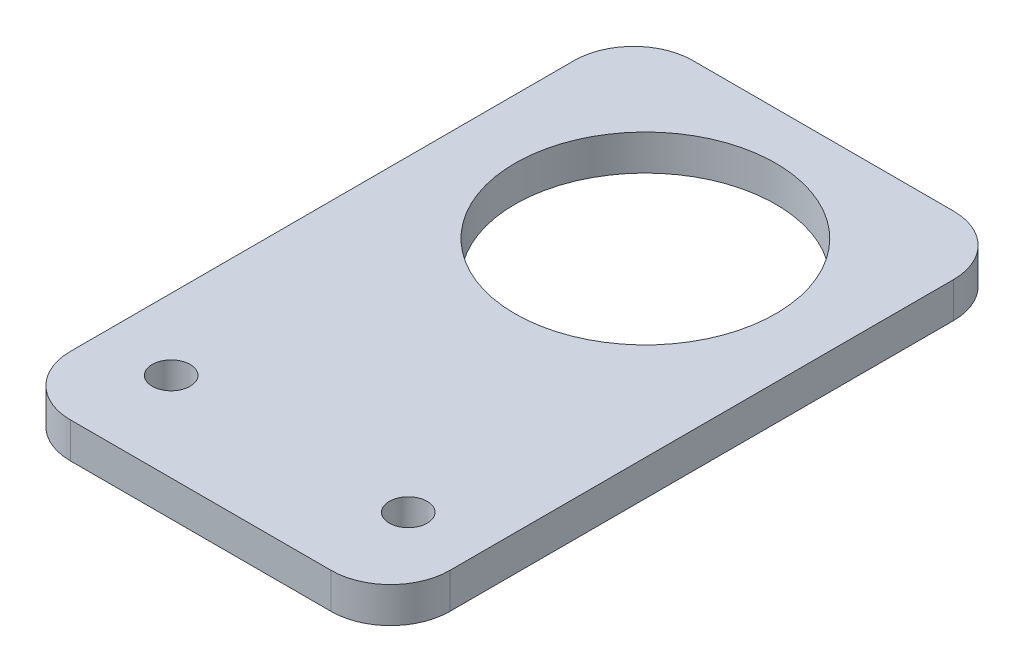
ISO-10303-21;
HEADER;
FILE_DESCRIPTION(('STEP AP214'),'2;1');
FILE_NAME('part.step','',(''),(''),'','','');
FILE_SCHEMA(('AUTOMOTIVE_DESIGN { 1 0 10303 214 1 1 1 1 }'));
ENDSEC;
DATA;
#1=APPLICATION_CONTEXT('core data for automotive mechanical design processes');
#2=APPLICATION_PROTOCOL_DEFINITION('international standard','automotive_design',2000,#1);
#3=PRODUCT_CONTEXT('',#1,'mechanical');
#4=PRODUCT('Part','Part','',(#3));
#5=PRODUCT_RELATED_PRODUCT_CATEGORY('part','',(#4));
#6=PRODUCT_DEFINITION_FORMATION('','',#4);
#7=PRODUCT_DEFINITION_CONTEXT('part definition',#1,'design');
#8=PRODUCT_DEFINITION('design','',#6,#7);
#9=PRODUCT_DEFINITION_SHAPE('','',#8);
#10=(LENGTH_UNIT() NAMED_UNIT(*) SI_UNIT(.MILLI.,.METRE.));
#11=(NAMED_UNIT(*) PLANE_ANGLE_UNIT() SI_UNIT($,.RADIAN.));
#12=(NAMED_UNIT(*) SI_UNIT($,.STERADIAN.) SOLID_ANGLE_UNIT());
#13=UNCERTAINTY_MEASURE_WITH_UNIT(LENGTH_MEASURE(1.E-05),#10,'distance_accuracy_value','');
#14=(GEOMETRIC_REPRESENTATION_CONTEXT(3) GLOBAL_UNCERTAINTY_ASSIGNED_CONTEXT((#13)) GLOBAL_UNIT_ASSIGNED_CONTEXT((#10,
#11,#12)) REPRESENTATION_CONTEXT('',''));
#15=CARTESIAN_POINT('',(0.,0.,0.));
#16=DIRECTION('',(0.,0.,1.));
#17=DIRECTION('',(1.,0.,0.));
#18=AXIS2_PLACEMENT_3D('',#15,#16,#17);
#19=CARTESIAN_POINT('',(0.,3.,0.));
#20=DIRECTION('',(0.,-1.,0.));
#21=DIRECTION('',(0.,0.,-1.));
#22=AXIS2_PLACEMENT_3D('',#19,#20,#21);
#23=PLANE('',#22);
#24=DIRECTION('',(-1.,0.,0.));
#25=VECTOR('',#24,1.);
#26=CARTESIAN_POINT('',(0.,3.,-52.5));
#27=LINE('',#26,#25);
#28=CARTESIAN_POINT('',(27.,3.,-52.5));
#29=VERTEX_POINT('',#28);
#30=CARTESIAN_POINT('',(5.00000000000001,3.,-52.5));
#31=VERTEX_POINT('',#30);
#32=EDGE_CURVE('E146',#29,#31,#27,.T.);
#33=ORIENTED_EDGE('',*,*,#32,.T.);
#34=CARTESIAN_POINT('',(5.00000000000001,3.,-47.5));
#35=DIRECTION('',(0.,-1.,0.));
#36=DIRECTION('',(0.,0.,-1.));
#37=AXIS2_PLACEMENT_3D('',#34,#35,#36);
#38=CIRCLE('',#37,5.);
#39=CARTESIAN_POINT('',(0.,3.,-47.5));
#40=VERTEX_POINT('',#39);
#41=EDGE_CURVE('E164',#31,#40,#38,.F.);
#42=ORIENTED_EDGE('',*,*,#41,.T.);
#43=DIRECTION('',(0.,0.,1.));
#44=VECTOR('',#43,1.);
#45=CARTESIAN_POINT('',(0.,3.,0.));
#46=LINE('',#45,#44);
#47=CARTESIAN_POINT('',(0.,3.,-5.));
#48=VERTEX_POINT('',#47);
#49=EDGE_CURVE('E128',#40,#48,#46,.T.);
#50=ORIENTED_EDGE('',*,*,#49,.T.);
#51=CARTESIAN_POINT('',(5.,3.,-5.));
#52=DIRECTION('',(0.,-1.,0.));
#53=DIRECTION('',(0.,0.,-1.));
#54=AXIS2_PLACEMENT_3D('',#51,#52,#53);
#55=CIRCLE('',#54,5.);
#56=CARTESIAN_POINT('',(5.,3.,0.));
#57=VERTEX_POINT('',#56);
#58=EDGE_CURVE('E160',#48,#57,#55,.F.);
#59=ORIENTED_EDGE('',*,*,#58,.T.);
#60=DIRECTION('',(1.,0.,0.));
#61=VECTOR('',#60,1.);
#62=CARTESIAN_POINT('',(0.,3.,0.));
#63=LINE('',#62,#61);
#64=CARTESIAN_POINT('',(27.,3.,0.));
#65=VERTEX_POINT('',#64);
#66=EDGE_CURVE('E173',#57,#65,#63,.T.);
#67=ORIENTED_EDGE('',*,*,#66,.T.);
#68=CARTESIAN_POINT('',(27.,3.,-5.));
#69=DIRECTION('',(0.,-1.,0.));
#70=DIRECTION('',(0.,0.,-1.));
#71=AXIS2_PLACEMENT_3D('',#68,#69,#70);
#72=CIRCLE('',#71,5.);
#73=CARTESIAN_POINT('',(32.,3.,-5.));
#74=VERTEX_POINT('',#73);
#75=EDGE_CURVE('E63',#65,#74,#72,.F.);
#76=ORIENTED_EDGE('',*,*,#75,.T.);
#77=DIRECTION('',(0.,0.,-1.));
#78=VECTOR('',#77,1.);
#79=CARTESIAN_POINT('',(32.,3.,0.));
#80=LINE('',#79,#78);
#81=CARTESIAN_POINT('',(32.,3.,-47.5));
#82=VERTEX_POINT('',#81);
#83=EDGE_CURVE('E179',#74,#82,#80,.T.);
#84=ORIENTED_EDGE('',*,*,#83,.T.);
#85=CARTESIAN_POINT('',(27.,3.,-47.5));
#86=DIRECTION('',(0.,-1.,0.));
#87=DIRECTION('',(0.,0.,-1.));
#88=AXIS2_PLACEMENT_3D('',#85,#86,#87);
#89=CIRCLE('',#88,5.);
#90=EDGE_CURVE('E162',#82,#29,#89,.F.);
#91=ORIENTED_EDGE('',*,*,#90,.T.);
#92=EDGE_LOOP('',(#33,#42,#50,#59,#67,#76,#84,#91));
#93=FACE_BOUND('',#92,.T.);
#94=CARTESIAN_POINT('',(16.,3.,-37.5));
#95=DIRECTION('',(0.,1.,0.));
#96=DIRECTION('',(0.,0.,1.));
#97=AXIS2_PLACEMENT_3D('',#94,#95,#96);
#98=CIRCLE('',#97,11.);
#99=CARTESIAN_POINT('',(16.,3.,-26.5));
#100=VERTEX_POINT('',#99);
#101=EDGE_CURVE('E137',#100,#100,#98,.T.);
#102=ORIENTED_EDGE('',*,*,#101,.F.);
#103=EDGE_LOOP('',(#102));
#104=FACE_BOUND('',#103,.T.);
#105=CARTESIAN_POINT('',(6.,3.,-7.5));
#106=DIRECTION('',(0.,1.,0.));
#107=DIRECTION('',(0.,0.,1.));
#108=AXIS2_PLACEMENT_3D('',#105,#106,#107);
#109=CIRCLE('',#108,1.6);
#110=CARTESIAN_POINT('',(6.,3.,-5.9));
#111=VERTEX_POINT('',#110);
#112=EDGE_CURVE('E194',#111,#111,#109,.T.);
#113=ORIENTED_EDGE('',*,*,#112,.F.);
#114=EDGE_LOOP('',(#113));
#115=FACE_BOUND('',#114,.T.);
#116=CARTESIAN_POINT('',(26.,3.,-7.5));
#117=DIRECTION('',(0.,1.,0.));
#118=DIRECTION('',(0.,0.,1.));
#119=AXIS2_PLACEMENT_3D('',#116,#117,#118);
#120=CIRCLE('',#119,1.6);
#121=CARTESIAN_POINT('',(26.,3.,-5.9));
#122=VERTEX_POINT('',#121);
#123=EDGE_CURVE('E199',#122,#122,#120,.T.);
#124=ORIENTED_EDGE('',*,*,#123,.F.);
#125=EDGE_LOOP('',(#124));
#126=FACE_BOUND('',#125,.T.);
#127=ADVANCED_FACE('F41',(#93,#104,#115,#126),#23,.F.);
#128=CARTESIAN_POINT('',(0.,0.,0.));
#129=DIRECTION('',(0.,-1.,0.));
#130=DIRECTION('',(0.,0.,-1.));
#131=AXIS2_PLACEMENT_3D('',#128,#129,#130);
#132=PLANE('',#131);
#133=CARTESIAN_POINT('',(6.,0.,-7.5));
#134=DIRECTION('',(0.,1.,0.));
#135=DIRECTION('',(0.,0.,1.));
#136=AXIS2_PLACEMENT_3D('',#133,#134,#135);
#137=CIRCLE('',#136,1.6);
#138=CARTESIAN_POINT('',(6.,0.,-5.9));
#139=VERTEX_POINT('',#138);
#140=EDGE_CURVE('E196',#139,#139,#137,.T.);
#141=ORIENTED_EDGE('',*,*,#140,.T.);
#142=EDGE_LOOP('',(#141));
#143=FACE_BOUND('',#142,.T.);
#144=DIRECTION('',(0.,0.,1.));
#145=VECTOR('',#144,1.);
#146=CARTESIAN_POINT('',(0.,0.,0.));
#147=LINE('',#146,#145);
#148=CARTESIAN_POINT('',(0.,0.,-47.5));
#149=VERTEX_POINT('',#148);
#150=CARTESIAN_POINT('',(0.,0.,-5.));
#151=VERTEX_POINT('',#150);
#152=EDGE_CURVE('E125',#149,#151,#147,.T.);
#153=ORIENTED_EDGE('',*,*,#152,.F.);
#154=CARTESIAN_POINT('',(5.00000000000001,0.,-47.5));
#155=DIRECTION('',(0.,-1.,0.));
#156=DIRECTION('',(0.,0.,-1.));
#157=AXIS2_PLACEMENT_3D('',#154,#155,#156);
#158=CIRCLE('',#157,5.);
#159=CARTESIAN_POINT('',(5.00000000000001,0.,-52.5));
#160=VERTEX_POINT('',#159);
#161=EDGE_CURVE('E108',#149,#160,#158,.T.);
#162=ORIENTED_EDGE('',*,*,#161,.T.);
#163=DIRECTION('',(-1.,0.,0.));
#164=VECTOR('',#163,1.);
#165=CARTESIAN_POINT('',(0.,0.,-52.5));
#166=LINE('',#165,#164);
#167=CARTESIAN_POINT('',(27.,0.,-52.5));
#168=VERTEX_POINT('',#167);
#169=EDGE_CURVE('E150',#168,#160,#166,.T.);
#170=ORIENTED_EDGE('',*,*,#169,.F.);
#171=CARTESIAN_POINT('',(27.,0.,-47.5));
#172=DIRECTION('',(0.,-1.,0.));
#173=DIRECTION('',(0.,0.,-1.));
#174=AXIS2_PLACEMENT_3D('',#171,#172,#173);
#175=CIRCLE('',#174,5.);
#176=CARTESIAN_POINT('',(32.,0.,-47.5));
#177=VERTEX_POINT('',#176);
#178=EDGE_CURVE('E119',#168,#177,#175,.T.);
#179=ORIENTED_EDGE('',*,*,#178,.T.);
#180=DIRECTION('',(0.,0.,-1.));
#181=VECTOR('',#180,1.);
#182=CARTESIAN_POINT('',(32.,0.,0.));
#183=LINE('',#182,#181);
#184=CARTESIAN_POINT('',(32.,0.,-5.));
#185=VERTEX_POINT('',#184);
#186=EDGE_CURVE('E140',#185,#177,#183,.T.);
#187=ORIENTED_EDGE('',*,*,#186,.F.);
#188=CARTESIAN_POINT('',(27.,0.,-5.));
#189=DIRECTION('',(0.,-1.,0.));
#190=DIRECTION('',(0.,0.,-1.));
#191=AXIS2_PLACEMENT_3D('',#188,#189,#190);
#192=CIRCLE('',#191,5.);
#193=CARTESIAN_POINT('',(27.,0.,0.));
#194=VERTEX_POINT('',#193);
#195=EDGE_CURVE('E129',#185,#194,#192,.T.);
#196=ORIENTED_EDGE('',*,*,#195,.T.);
#197=DIRECTION('',(1.,0.,0.));
#198=VECTOR('',#197,1.);
#199=CARTESIAN_POINT('',(0.,0.,0.));
#200=LINE('',#199,#198);
#201=CARTESIAN_POINT('',(5.,0.,0.));
#202=VERTEX_POINT('',#201);
#203=EDGE_CURVE('E136',#202,#194,#200,.T.);
#204=ORIENTED_EDGE('',*,*,#203,.F.);
#205=CARTESIAN_POINT('',(5.,0.,-5.));
#206=DIRECTION('',(0.,-1.,0.));
#207=DIRECTION('',(0.,0.,-1.));
#208=AXIS2_PLACEMENT_3D('',#205,#206,#207);
#209=CIRCLE('',#208,5.);
#210=EDGE_CURVE('E135',#202,#151,#209,.T.);
#211=ORIENTED_EDGE('',*,*,#210,.T.);
#212=EDGE_LOOP('',(#153,#162,#170,#179,#187,#196,#204,#211));
#213=FACE_BOUND('',#212,.T.);
#214=CARTESIAN_POINT('',(16.,0.,-37.5));
#215=DIRECTION('',(0.,1.,0.));
#216=DIRECTION('',(0.,0.,1.));
#217=AXIS2_PLACEMENT_3D('',#214,#215,#216);
#218=CIRCLE('',#217,11.);
#219=CARTESIAN_POINT('',(16.,0.,-26.5));
#220=VERTEX_POINT('',#219);
#221=EDGE_CURVE('E143',#220,#220,#218,.T.);
#222=ORIENTED_EDGE('',*,*,#221,.T.);
#223=EDGE_LOOP('',(#222));
#224=FACE_BOUND('',#223,.T.);
#225=CARTESIAN_POINT('',(26.,0.,-7.5));
#226=DIRECTION('',(0.,1.,0.));
#227=DIRECTION('',(0.,0.,1.));
#228=AXIS2_PLACEMENT_3D('',#225,#226,#227);
#229=CIRCLE('',#228,1.6);
#230=CARTESIAN_POINT('',(26.,0.,-5.9));
#231=VERTEX_POINT('',#230);
#232=EDGE_CURVE('E202',#231,#231,#229,.T.);
#233=ORIENTED_EDGE('',*,*,#232,.T.);
#234=EDGE_LOOP('',(#233));
#235=FACE_BOUND('',#234,.T.);
#236=ADVANCED_FACE('F132',(#143,#213,#224,#235),#132,.T.);
#237=CARTESIAN_POINT('',(0.,3.,0.));
#238=DIRECTION('',(1.,0.,0.));
#239=DIRECTION('',(0.,0.,-1.));
#240=AXIS2_PLACEMENT_3D('',#237,#238,#239);
#241=PLANE('',#240);
#242=ORIENTED_EDGE('',*,*,#49,.F.);
#243=DIRECTION('',(0.,-1.,0.));
#244=VECTOR('',#243,1.);
#245=CARTESIAN_POINT('',(0.,3.,-47.5));
#246=LINE('',#245,#244);
#247=EDGE_CURVE('E112',#40,#149,#246,.T.);
#248=ORIENTED_EDGE('',*,*,#247,.T.);
#249=ORIENTED_EDGE('',*,*,#152,.T.);
#250=DIRECTION('',(0.,-1.,0.));
#251=VECTOR('',#250,1.);
#252=CARTESIAN_POINT('',(0.,3.,-5.));
#253=LINE('',#252,#251);
#254=EDGE_CURVE('E130',#151,#48,#253,.F.);
#255=ORIENTED_EDGE('',*,*,#254,.T.);
#256=EDGE_LOOP('',(#242,#248,#249,#255));
#257=FACE_BOUND('',#256,.T.);
#258=ADVANCED_FACE('F124',(#257),#241,.F.);
#259=CARTESIAN_POINT('',(0.,3.,0.));
#260=DIRECTION('',(0.,0.,-1.));
#261=DIRECTION('',(-1.,0.,0.));
#262=AXIS2_PLACEMENT_3D('',#259,#260,#261);
#263=PLANE('',#262);
#264=ORIENTED_EDGE('',*,*,#66,.F.);
#265=DIRECTION('',(0.,-1.,0.));
#266=VECTOR('',#265,1.);
#267=CARTESIAN_POINT('',(5.,3.,0.));
#268=LINE('',#267,#266);
#269=EDGE_CURVE('E11',#57,#202,#268,.T.);
#270=ORIENTED_EDGE('',*,*,#269,.T.);
#271=ORIENTED_EDGE('',*,*,#203,.T.);
#272=DIRECTION('',(0.,-1.,0.));
#273=VECTOR('',#272,1.);
#274=CARTESIAN_POINT('',(27.,3.,0.));
#275=LINE('',#274,#273);
#276=EDGE_CURVE('E49',#194,#65,#275,.F.);
#277=ORIENTED_EDGE('',*,*,#276,.T.);
#278=EDGE_LOOP('',(#264,#270,#271,#277));
#279=FACE_BOUND('',#278,.T.);
#280=ADVANCED_FACE('F172',(#279),#263,.F.);
#281=CARTESIAN_POINT('',(32.,3.,0.));
#282=DIRECTION('',(-1.,0.,0.));
#283=DIRECTION('',(0.,0.,1.));
#284=AXIS2_PLACEMENT_3D('',#281,#282,#283);
#285=PLANE('',#284);
#286=ORIENTED_EDGE('',*,*,#186,.T.);
#287=DIRECTION('',(0.,-1.,0.));
#288=VECTOR('',#287,1.);
#289=CARTESIAN_POINT('',(32.,3.,-47.5));
#290=LINE('',#289,#288);
#291=EDGE_CURVE('E56',#177,#82,#290,.F.);
#292=ORIENTED_EDGE('',*,*,#291,.T.);
#293=ORIENTED_EDGE('',*,*,#83,.F.);
#294=DIRECTION('',(0.,-1.,0.));
#295=VECTOR('',#294,1.);
#296=CARTESIAN_POINT('',(32.,3.,-5.));
#297=LINE('',#296,#295);
#298=EDGE_CURVE('E166',#74,#185,#297,.T.);
#299=ORIENTED_EDGE('',*,*,#298,.T.);
#300=EDGE_LOOP('',(#286,#292,#293,#299));
#301=FACE_BOUND('',#300,.T.);
#302=ADVANCED_FACE('F183',(#301),#285,.F.);
#303=CARTESIAN_POINT('',(0.,3.,-52.5));
#304=DIRECTION('',(0.,0.,1.));
#305=DIRECTION('',(1.,0.,0.));
#306=AXIS2_PLACEMENT_3D('',#303,#304,#305);
#307=PLANE('',#306);
#308=ORIENTED_EDGE('',*,*,#169,.T.);
#309=DIRECTION('',(0.,-1.,0.));
#310=VECTOR('',#309,1.);
#311=CARTESIAN_POINT('',(5.00000000000001,3.,-52.5));
#312=LINE('',#311,#310);
#313=EDGE_CURVE('E113',#160,#31,#312,.F.);
#314=ORIENTED_EDGE('',*,*,#313,.T.);
#315=ORIENTED_EDGE('',*,*,#32,.F.);
#316=DIRECTION('',(0.,-1.,0.));
#317=VECTOR('',#316,1.);
#318=CARTESIAN_POINT('',(27.,3.,-52.5));
#319=LINE('',#318,#317);
#320=EDGE_CURVE('E118',#29,#168,#319,.T.);
#321=ORIENTED_EDGE('',*,*,#320,.T.);
#322=EDGE_LOOP('',(#308,#314,#315,#321));
#323=FACE_BOUND('',#322,.T.);
#324=ADVANCED_FACE('F190',(#323),#307,.F.);
#325=CARTESIAN_POINT('',(16.,3.,-37.5));
#326=DIRECTION('',(0.,-1.,0.));
#327=DIRECTION('',(0.,0.,-1.));
#328=AXIS2_PLACEMENT_3D('',#325,#326,#327);
#329=CYLINDRICAL_SURFACE('',#328,11.);
#330=ORIENTED_EDGE('',*,*,#101,.T.);
#331=EDGE_LOOP('',(#330));
#332=FACE_BOUND('',#331,.T.);
#333=ORIENTED_EDGE('',*,*,#221,.F.);
#334=EDGE_LOOP('',(#333));
#335=FACE_BOUND('',#334,.T.);
#336=ADVANCED_FACE('F220',(#332,#335),#329,.F.);
#337=CARTESIAN_POINT('',(6.,3.,-7.5));
#338=DIRECTION('',(0.,-1.,0.));
#339=DIRECTION('',(0.,0.,-1.));
#340=AXIS2_PLACEMENT_3D('',#337,#338,#339);
#341=CYLINDRICAL_SURFACE('',#340,1.6);
#342=ORIENTED_EDGE('',*,*,#112,.T.);
#343=EDGE_LOOP('',(#342));
#344=FACE_BOUND('',#343,.T.);
#345=ORIENTED_EDGE('',*,*,#140,.F.);
#346=EDGE_LOOP('',(#345));
#347=FACE_BOUND('',#346,.T.);
#348=ADVANCED_FACE('F267',(#344,#347),#341,.F.);
#349=CARTESIAN_POINT('',(26.,3.,-7.5));
#350=DIRECTION('',(0.,-1.,0.));
#351=DIRECTION('',(0.,0.,-1.));
#352=AXIS2_PLACEMENT_3D('',#349,#350,#351);
#353=CYLINDRICAL_SURFACE('',#352,1.6);
#354=ORIENTED_EDGE('',*,*,#123,.T.);
#355=EDGE_LOOP('',(#354));
#356=FACE_BOUND('',#355,.T.);
#357=ORIENTED_EDGE('',*,*,#232,.F.);
#358=EDGE_LOOP('',(#357));
#359=FACE_BOUND('',#358,.T.);
#360=ADVANCED_FACE('F208',(#356,#359),#353,.F.);
#361=CARTESIAN_POINT('',(5.00000000000001,3.,-47.5));
#362=DIRECTION('',(0.,-1.,0.));
#363=DIRECTION('',(0.,0.,-1.));
#364=AXIS2_PLACEMENT_3D('',#361,#362,#363);
#365=CYLINDRICAL_SURFACE('',#364,5.);
#366=ORIENTED_EDGE('',*,*,#41,.F.);
#367=ORIENTED_EDGE('',*,*,#313,.F.);
#368=ORIENTED_EDGE('',*,*,#161,.F.);
#369=ORIENTED_EDGE('',*,*,#247,.F.);
#370=EDGE_LOOP('',(#366,#367,#368,#369));
#371=FACE_BOUND('',#370,.T.);
#372=ADVANCED_FACE('F111',(#371),#365,.T.);
#373=CARTESIAN_POINT('',(27.,3.,-47.5));
#374=DIRECTION('',(0.,-1.,0.));
#375=DIRECTION('',(0.,0.,-1.));
#376=AXIS2_PLACEMENT_3D('',#373,#374,#375);
#377=CYLINDRICAL_SURFACE('',#376,5.);
#378=ORIENTED_EDGE('',*,*,#90,.F.);
#379=ORIENTED_EDGE('',*,*,#291,.F.);
#380=ORIENTED_EDGE('',*,*,#178,.F.);
#381=ORIENTED_EDGE('',*,*,#320,.F.);
#382=EDGE_LOOP('',(#378,#379,#380,#381));
#383=FACE_BOUND('',#382,.T.);
#384=ADVANCED_FACE('F187',(#383),#377,.T.);
#385=CARTESIAN_POINT('',(5.,3.,-5.));
#386=DIRECTION('',(0.,-1.,0.));
#387=DIRECTION('',(0.,0.,-1.));
#388=AXIS2_PLACEMENT_3D('',#385,#386,#387);
#389=CYLINDRICAL_SURFACE('',#388,5.);
#390=ORIENTED_EDGE('',*,*,#58,.F.);
#391=ORIENTED_EDGE('',*,*,#254,.F.);
#392=ORIENTED_EDGE('',*,*,#210,.F.);
#393=ORIENTED_EDGE('',*,*,#269,.F.);
#394=EDGE_LOOP('',(#390,#391,#392,#393));
#395=FACE_BOUND('',#394,.T.);
#396=ADVANCED_FACE('F234',(#395),#389,.T.);
#397=CARTESIAN_POINT('',(27.,3.,-5.));
#398=DIRECTION('',(0.,-1.,0.));
#399=DIRECTION('',(0.,0.,-1.));
#400=AXIS2_PLACEMENT_3D('',#397,#398,#399);
#401=CYLINDRICAL_SURFACE('',#400,5.);
#402=ORIENTED_EDGE('',*,*,#75,.F.);
#403=ORIENTED_EDGE('',*,*,#276,.F.);
#404=ORIENTED_EDGE('',*,*,#195,.F.);
#405=ORIENTED_EDGE('',*,*,#298,.F.);
#406=EDGE_LOOP('',(#402,#403,#404,#405));
#407=FACE_BOUND('',#406,.T.);
#408=ADVANCED_FACE('F43',(#407),#401,.T.);
#409=CLOSED_SHELL('',(#127,#236,#258,#280,#302,#324,#336,#348,#360,#372,#384,#396,#408));
#410=MANIFOLD_SOLID_BREP('B2',#409);
#411=ADVANCED_BREP_SHAPE_REPRESENTATION('',(#18,#410),#14);
#412=SHAPE_DEFINITION_REPRESENTATION(#9,#411);
ENDSEC;
END-ISO-10303-21;
